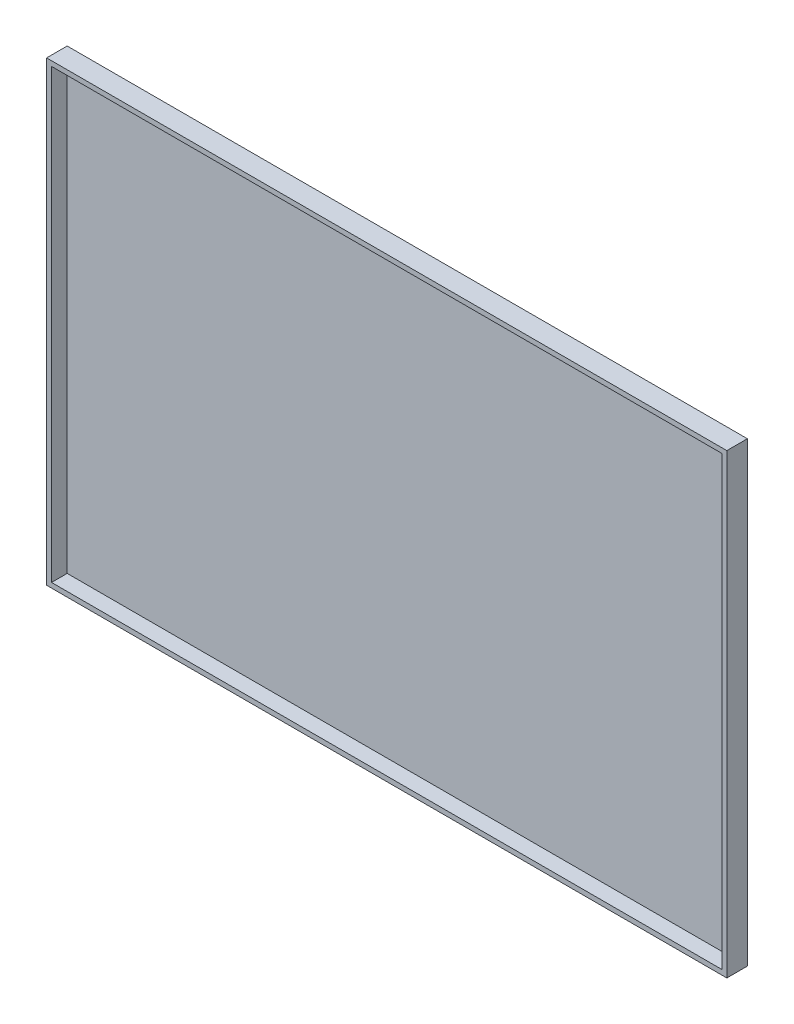
ISO-10303-21;
HEADER;
FILE_DESCRIPTION(('STEP AP214'),'2;1');
FILE_NAME('part.step','',(''),(''),'','','');
FILE_SCHEMA(('AUTOMOTIVE_DESIGN { 1 0 10303 214 1 1 1 1 }'));
ENDSEC;
DATA;
#1=APPLICATION_CONTEXT('core data for automotive mechanical design processes');
#2=APPLICATION_PROTOCOL_DEFINITION('international standard','automotive_design',2000,#1);
#3=PRODUCT_CONTEXT('',#1,'mechanical');
#4=PRODUCT('Part','Part','',(#3));
#5=PRODUCT_RELATED_PRODUCT_CATEGORY('part','',(#4));
#6=PRODUCT_DEFINITION_FORMATION('','',#4);
#7=PRODUCT_DEFINITION_CONTEXT('part definition',#1,'design');
#8=PRODUCT_DEFINITION('design','',#6,#7);
#9=PRODUCT_DEFINITION_SHAPE('','',#8);
#10=(LENGTH_UNIT() NAMED_UNIT(*) SI_UNIT(.MILLI.,.METRE.));
#11=(NAMED_UNIT(*) PLANE_ANGLE_UNIT() SI_UNIT($,.RADIAN.));
#12=(NAMED_UNIT(*) SI_UNIT($,.STERADIAN.) SOLID_ANGLE_UNIT());
#13=UNCERTAINTY_MEASURE_WITH_UNIT(LENGTH_MEASURE(1.E-05),#10,'distance_accuracy_value','');
#14=(GEOMETRIC_REPRESENTATION_CONTEXT(3) GLOBAL_UNCERTAINTY_ASSIGNED_CONTEXT((#13)) GLOBAL_UNIT_ASSIGNED_CONTEXT((#10,
#11,#12)) REPRESENTATION_CONTEXT('',''));
#15=CARTESIAN_POINT('',(0.,0.,0.));
#16=DIRECTION('',(0.,0.,1.));
#17=DIRECTION('',(1.,0.,0.));
#18=AXIS2_PLACEMENT_3D('',#15,#16,#17);
#19=CARTESIAN_POINT('',(1522.,1022.,92.));
#20=DIRECTION('',(1.,0.,0.));
#21=DIRECTION('',(0.,1.,0.));
#22=AXIS2_PLACEMENT_3D('',#19,#20,#21);
#23=PLANE('',#22);
#24=DIRECTION('',(0.,-1.,0.));
#25=VECTOR('',#24,1.);
#26=CARTESIAN_POINT('',(1522.,1022.,0.));
#27=LINE('',#26,#25);
#28=CARTESIAN_POINT('',(1522.,1022.,0.));
#29=VERTEX_POINT('',#28);
#30=CARTESIAN_POINT('',(1522.,-1022.,0.));
#31=VERTEX_POINT('',#30);
#32=EDGE_CURVE('E141',#29,#31,#27,.T.);
#33=ORIENTED_EDGE('',*,*,#32,.F.);
#34=DIRECTION('',(0.,0.,-1.));
#35=VECTOR('',#34,1.);
#36=CARTESIAN_POINT('',(1522.,1022.,92.));
#37=LINE('',#36,#35);
#38=CARTESIAN_POINT('',(1522.,1022.,92.));
#39=VERTEX_POINT('',#38);
#40=EDGE_CURVE('E12',#39,#29,#37,.T.);
#41=ORIENTED_EDGE('',*,*,#40,.F.);
#42=DIRECTION('',(0.,-1.,0.));
#43=VECTOR('',#42,1.);
#44=CARTESIAN_POINT('',(1522.,1022.,92.));
#45=LINE('',#44,#43);
#46=CARTESIAN_POINT('',(1522.,-1022.,92.));
#47=VERTEX_POINT('',#46);
#48=EDGE_CURVE('E145',#39,#47,#45,.T.);
#49=ORIENTED_EDGE('',*,*,#48,.T.);
#50=DIRECTION('',(0.,0.,-1.));
#51=VECTOR('',#50,1.);
#52=CARTESIAN_POINT('',(1522.,-1022.,92.));
#53=LINE('',#52,#51);
#54=EDGE_CURVE('E46',#47,#31,#53,.T.);
#55=ORIENTED_EDGE('',*,*,#54,.T.);
#56=EDGE_LOOP('',(#33,#41,#49,#55));
#57=FACE_BOUND('',#56,.T.);
#58=ADVANCED_FACE('F43',(#57),#23,.T.);
#59=CARTESIAN_POINT('',(1522.,1022.,92.));
#60=DIRECTION('',(0.,1.,0.));
#61=DIRECTION('',(0.,0.,1.));
#62=AXIS2_PLACEMENT_3D('',#59,#60,#61);
#63=PLANE('',#62);
#64=DIRECTION('',(1.,0.,0.));
#65=VECTOR('',#64,1.);
#66=CARTESIAN_POINT('',(1522.,1022.,0.));
#67=LINE('',#66,#65);
#68=CARTESIAN_POINT('',(-1522.,1022.,0.));
#69=VERTEX_POINT('',#68);
#70=EDGE_CURVE('E149',#69,#29,#67,.T.);
#71=ORIENTED_EDGE('',*,*,#70,.F.);
#72=DIRECTION('',(0.,0.,-1.));
#73=VECTOR('',#72,1.);
#74=CARTESIAN_POINT('',(-1522.,1022.,92.));
#75=LINE('',#74,#73);
#76=CARTESIAN_POINT('',(-1522.,1022.,92.));
#77=VERTEX_POINT('',#76);
#78=EDGE_CURVE('E51',#77,#69,#75,.T.);
#79=ORIENTED_EDGE('',*,*,#78,.F.);
#80=DIRECTION('',(1.,0.,0.));
#81=VECTOR('',#80,1.);
#82=CARTESIAN_POINT('',(1522.,1022.,92.));
#83=LINE('',#82,#81);
#84=EDGE_CURVE('E155',#77,#39,#83,.T.);
#85=ORIENTED_EDGE('',*,*,#84,.T.);
#86=ORIENTED_EDGE('',*,*,#40,.T.);
#87=EDGE_LOOP('',(#71,#79,#85,#86));
#88=FACE_BOUND('',#87,.T.);
#89=ADVANCED_FACE('F181',(#88),#63,.T.);
#90=CARTESIAN_POINT('',(-1522.,1022.,92.));
#91=DIRECTION('',(-1.,0.,0.));
#92=DIRECTION('',(0.,-1.,0.));
#93=AXIS2_PLACEMENT_3D('',#90,#91,#92);
#94=PLANE('',#93);
#95=DIRECTION('',(0.,1.,0.));
#96=VECTOR('',#95,1.);
#97=CARTESIAN_POINT('',(-1522.,1022.,0.));
#98=LINE('',#97,#96);
#99=CARTESIAN_POINT('',(-1522.,-1022.,0.));
#100=VERTEX_POINT('',#99);
#101=EDGE_CURVE('E163',#100,#69,#98,.T.);
#102=ORIENTED_EDGE('',*,*,#101,.F.);
#103=DIRECTION('',(0.,0.,-1.));
#104=VECTOR('',#103,1.);
#105=CARTESIAN_POINT('',(-1522.,-1022.,92.));
#106=LINE('',#105,#104);
#107=CARTESIAN_POINT('',(-1522.,-1022.,92.));
#108=VERTEX_POINT('',#107);
#109=EDGE_CURVE('E168',#108,#100,#106,.T.);
#110=ORIENTED_EDGE('',*,*,#109,.F.);
#111=DIRECTION('',(0.,1.,0.));
#112=VECTOR('',#111,1.);
#113=CARTESIAN_POINT('',(-1522.,1022.,92.));
#114=LINE('',#113,#112);
#115=EDGE_CURVE('E152',#108,#77,#114,.T.);
#116=ORIENTED_EDGE('',*,*,#115,.T.);
#117=ORIENTED_EDGE('',*,*,#78,.T.);
#118=EDGE_LOOP('',(#102,#110,#116,#117));
#119=FACE_BOUND('',#118,.T.);
#120=ADVANCED_FACE('F185',(#119),#94,.T.);
#121=CARTESIAN_POINT('',(1522.,-1022.,92.));
#122=DIRECTION('',(0.,-1.,0.));
#123=DIRECTION('',(0.,0.,-1.));
#124=AXIS2_PLACEMENT_3D('',#121,#122,#123);
#125=PLANE('',#124);
#126=DIRECTION('',(-1.,0.,0.));
#127=VECTOR('',#126,1.);
#128=CARTESIAN_POINT('',(1522.,-1022.,0.));
#129=LINE('',#128,#127);
#130=EDGE_CURVE('E160',#31,#100,#129,.T.);
#131=ORIENTED_EDGE('',*,*,#130,.F.);
#132=ORIENTED_EDGE('',*,*,#54,.F.);
#133=DIRECTION('',(-1.,0.,0.));
#134=VECTOR('',#133,1.);
#135=CARTESIAN_POINT('',(1522.,-1022.,92.));
#136=LINE('',#135,#134);
#137=EDGE_CURVE('E148',#47,#108,#136,.T.);
#138=ORIENTED_EDGE('',*,*,#137,.T.);
#139=ORIENTED_EDGE('',*,*,#109,.T.);
#140=EDGE_LOOP('',(#131,#132,#138,#139));
#141=FACE_BOUND('',#140,.T.);
#142=ADVANCED_FACE('F176',(#141),#125,.T.);
#143=CARTESIAN_POINT('',(0.,0.,92.));
#144=DIRECTION('',(0.,0.,-1.));
#145=DIRECTION('',(-1.,0.,0.));
#146=AXIS2_PLACEMENT_3D('',#143,#144,#145);
#147=PLANE('',#146);
#148=DIRECTION('',(-1.,0.,0.));
#149=VECTOR('',#148,1.);
#150=CARTESIAN_POINT('',(-1500.,-1000.,92.));
#151=LINE('',#150,#149);
#152=CARTESIAN_POINT('',(1500.,-1000.,92.));
#153=VERTEX_POINT('',#152);
#154=CARTESIAN_POINT('',(-1500.,-1000.,92.));
#155=VERTEX_POINT('',#154);
#156=EDGE_CURVE('E116',#153,#155,#151,.T.);
#157=ORIENTED_EDGE('',*,*,#156,.T.);
#158=DIRECTION('',(0.,1.,0.));
#159=VECTOR('',#158,1.);
#160=CARTESIAN_POINT('',(-1500.,1000.,92.));
#161=LINE('',#160,#159);
#162=CARTESIAN_POINT('',(-1500.,1000.,92.));
#163=VERTEX_POINT('',#162);
#164=EDGE_CURVE('E110',#155,#163,#161,.T.);
#165=ORIENTED_EDGE('',*,*,#164,.T.);
#166=DIRECTION('',(1.,0.,0.));
#167=VECTOR('',#166,1.);
#168=CARTESIAN_POINT('',(-1500.,1000.,92.));
#169=LINE('',#168,#167);
#170=CARTESIAN_POINT('',(1500.,1000.,92.));
#171=VERTEX_POINT('',#170);
#172=EDGE_CURVE('E119',#163,#171,#169,.T.);
#173=ORIENTED_EDGE('',*,*,#172,.T.);
#174=DIRECTION('',(0.,-1.,0.));
#175=VECTOR('',#174,1.);
#176=CARTESIAN_POINT('',(1500.,1000.,92.));
#177=LINE('',#176,#175);
#178=EDGE_CURVE('E59',#171,#153,#177,.T.);
#179=ORIENTED_EDGE('',*,*,#178,.T.);
#180=EDGE_LOOP('',(#157,#165,#173,#179));
#181=FACE_BOUND('',#180,.T.);
#182=ORIENTED_EDGE('',*,*,#48,.F.);
#183=ORIENTED_EDGE('',*,*,#84,.F.);
#184=ORIENTED_EDGE('',*,*,#115,.F.);
#185=ORIENTED_EDGE('',*,*,#137,.F.);
#186=EDGE_LOOP('',(#182,#183,#184,#185));
#187=FACE_BOUND('',#186,.T.);
#188=ADVANCED_FACE('F123',(#181,#187),#147,.F.);
#189=CARTESIAN_POINT('',(0.,0.,0.));
#190=DIRECTION('',(0.,0.,-1.));
#191=DIRECTION('',(-1.,0.,0.));
#192=AXIS2_PLACEMENT_3D('',#189,#190,#191);
#193=PLANE('',#192);
#194=DIRECTION('',(0.,1.,0.));
#195=VECTOR('',#194,1.);
#196=CARTESIAN_POINT('',(-1500.,1000.,0.));
#197=LINE('',#196,#195);
#198=CARTESIAN_POINT('',(-1500.,-1000.,0.));
#199=VERTEX_POINT('',#198);
#200=CARTESIAN_POINT('',(-1500.,1000.,0.));
#201=VERTEX_POINT('',#200);
#202=EDGE_CURVE('E67',#199,#201,#197,.T.);
#203=ORIENTED_EDGE('',*,*,#202,.F.);
#204=DIRECTION('',(-1.,0.,0.));
#205=VECTOR('',#204,1.);
#206=CARTESIAN_POINT('',(-1500.,-1000.,0.));
#207=LINE('',#206,#205);
#208=CARTESIAN_POINT('',(1500.,-1000.,0.));
#209=VERTEX_POINT('',#208);
#210=EDGE_CURVE('E126',#209,#199,#207,.T.);
#211=ORIENTED_EDGE('',*,*,#210,.F.);
#212=DIRECTION('',(0.,-1.,0.));
#213=VECTOR('',#212,1.);
#214=CARTESIAN_POINT('',(1500.,1000.,0.));
#215=LINE('',#214,#213);
#216=CARTESIAN_POINT('',(1500.,1000.,0.));
#217=VERTEX_POINT('',#216);
#218=EDGE_CURVE('E129',#217,#209,#215,.T.);
#219=ORIENTED_EDGE('',*,*,#218,.F.);
#220=DIRECTION('',(1.,0.,0.));
#221=VECTOR('',#220,1.);
#222=CARTESIAN_POINT('',(-1500.,1000.,0.));
#223=LINE('',#222,#221);
#224=EDGE_CURVE('E135',#201,#217,#223,.T.);
#225=ORIENTED_EDGE('',*,*,#224,.F.);
#226=EDGE_LOOP('',(#203,#211,#219,#225));
#227=FACE_BOUND('',#226,.T.);
#228=ORIENTED_EDGE('',*,*,#32,.T.);
#229=ORIENTED_EDGE('',*,*,#130,.T.);
#230=ORIENTED_EDGE('',*,*,#101,.T.);
#231=ORIENTED_EDGE('',*,*,#70,.T.);
#232=EDGE_LOOP('',(#228,#229,#230,#231));
#233=FACE_BOUND('',#232,.T.);
#234=ADVANCED_FACE('F178',(#227,#233),#193,.T.);
#235=CARTESIAN_POINT('',(-1500.,1000.,92.));
#236=DIRECTION('',(-1.,0.,0.));
#237=DIRECTION('',(0.,0.,1.));
#238=AXIS2_PLACEMENT_3D('',#235,#236,#237);
#239=PLANE('',#238);
#240=ORIENTED_EDGE('',*,*,#202,.T.);
#241=DIRECTION('',(0.,0.,-1.));
#242=VECTOR('',#241,1.);
#243=CARTESIAN_POINT('',(-1500.,1000.,92.));
#244=LINE('',#243,#242);
#245=EDGE_CURVE('E106',#163,#201,#244,.T.);
#246=ORIENTED_EDGE('',*,*,#245,.F.);
#247=ORIENTED_EDGE('',*,*,#164,.F.);
#248=DIRECTION('',(0.,0.,-1.));
#249=VECTOR('',#248,1.);
#250=CARTESIAN_POINT('',(-1500.,-1000.,92.));
#251=LINE('',#250,#249);
#252=EDGE_CURVE('E139',#155,#199,#251,.T.);
#253=ORIENTED_EDGE('',*,*,#252,.T.);
#254=EDGE_LOOP('',(#240,#246,#247,#253));
#255=FACE_BOUND('',#254,.T.);
#256=ADVANCED_FACE('F108',(#255),#239,.F.);
#257=CARTESIAN_POINT('',(-1500.,-1000.,92.));
#258=DIRECTION('',(0.,-1.,0.));
#259=DIRECTION('',(1.,0.,0.));
#260=AXIS2_PLACEMENT_3D('',#257,#258,#259);
#261=PLANE('',#260);
#262=ORIENTED_EDGE('',*,*,#210,.T.);
#263=ORIENTED_EDGE('',*,*,#252,.F.);
#264=ORIENTED_EDGE('',*,*,#156,.F.);
#265=DIRECTION('',(0.,0.,-1.));
#266=VECTOR('',#265,1.);
#267=CARTESIAN_POINT('',(1500.,-1000.,92.));
#268=LINE('',#267,#266);
#269=EDGE_CURVE('E142',#153,#209,#268,.T.);
#270=ORIENTED_EDGE('',*,*,#269,.T.);
#271=EDGE_LOOP('',(#262,#263,#264,#270));
#272=FACE_BOUND('',#271,.T.);
#273=ADVANCED_FACE('F236',(#272),#261,.F.);
#274=CARTESIAN_POINT('',(1500.,1000.,92.));
#275=DIRECTION('',(1.,0.,0.));
#276=DIRECTION('',(0.,1.,0.));
#277=AXIS2_PLACEMENT_3D('',#274,#275,#276);
#278=PLANE('',#277);
#279=ORIENTED_EDGE('',*,*,#218,.T.);
#280=ORIENTED_EDGE('',*,*,#269,.F.);
#281=ORIENTED_EDGE('',*,*,#178,.F.);
#282=DIRECTION('',(0.,0.,-1.));
#283=VECTOR('',#282,1.);
#284=CARTESIAN_POINT('',(1500.,1000.,92.));
#285=LINE('',#284,#283);
#286=EDGE_CURVE('E115',#171,#217,#285,.T.);
#287=ORIENTED_EDGE('',*,*,#286,.T.);
#288=EDGE_LOOP('',(#279,#280,#281,#287));
#289=FACE_BOUND('',#288,.T.);
#290=ADVANCED_FACE('F245',(#289),#278,.F.);
#291=CARTESIAN_POINT('',(-1500.,1000.,92.));
#292=DIRECTION('',(0.,1.,0.));
#293=DIRECTION('',(0.,0.,1.));
#294=AXIS2_PLACEMENT_3D('',#291,#292,#293);
#295=PLANE('',#294);
#296=ORIENTED_EDGE('',*,*,#224,.T.);
#297=ORIENTED_EDGE('',*,*,#286,.F.);
#298=ORIENTED_EDGE('',*,*,#172,.F.);
#299=ORIENTED_EDGE('',*,*,#245,.T.);
#300=EDGE_LOOP('',(#296,#297,#298,#299));
#301=FACE_BOUND('',#300,.T.);
#302=ADVANCED_FACE('F120',(#301),#295,.F.);
#303=CLOSED_SHELL('',(#58,#89,#120,#142,#188,#234,#256,#273,#290,#302));
#304=MANIFOLD_SOLID_BREP('B2',#303);
#305=CARTESIAN_POINT('',(-1500.,1000.,22.));
#306=DIRECTION('',(1.,0.,0.));
#307=DIRECTION('',(0.,0.,-1.));
#308=AXIS2_PLACEMENT_3D('',#305,#306,#307);
#309=PLANE('',#308);
#310=DIRECTION('',(0.,-1.,0.));
#311=VECTOR('',#310,1.);
#312=CARTESIAN_POINT('',(-1500.,1000.,0.));
#313=LINE('',#312,#311);
#314=CARTESIAN_POINT('',(-1500.,1000.,0.));
#315=VERTEX_POINT('',#314);
#316=CARTESIAN_POINT('',(-1500.,-1000.,0.));
#317=VERTEX_POINT('',#316);
#318=EDGE_CURVE('E335',#315,#317,#313,.T.);
#319=ORIENTED_EDGE('',*,*,#318,.T.);
#320=DIRECTION('',(0.,0.,-1.));
#321=VECTOR('',#320,1.);
#322=CARTESIAN_POINT('',(-1500.,-1000.,22.));
#323=LINE('',#322,#321);
#324=CARTESIAN_POINT('',(-1500.,-1000.,22.));
#325=VERTEX_POINT('',#324);
#326=EDGE_CURVE('E41',#325,#317,#323,.T.);
#327=ORIENTED_EDGE('',*,*,#326,.F.);
#328=DIRECTION('',(0.,-1.,0.));
#329=VECTOR('',#328,1.);
#330=CARTESIAN_POINT('',(-1500.,1000.,22.));
#331=LINE('',#330,#329);
#332=CARTESIAN_POINT('',(-1500.,1000.,22.));
#333=VERTEX_POINT('',#332);
#334=EDGE_CURVE('E323',#333,#325,#331,.T.);
#335=ORIENTED_EDGE('',*,*,#334,.F.);
#336=DIRECTION('',(0.,0.,-1.));
#337=VECTOR('',#336,1.);
#338=CARTESIAN_POINT('',(-1500.,1000.,22.));
#339=LINE('',#338,#337);
#340=EDGE_CURVE('E331',#333,#315,#339,.T.);
#341=ORIENTED_EDGE('',*,*,#340,.T.);
#342=EDGE_LOOP('',(#319,#327,#335,#341));
#343=FACE_BOUND('',#342,.T.);
#344=ADVANCED_FACE('F272',(#343),#309,.F.);
#345=CARTESIAN_POINT('',(-1500.,-1000.,22.));
#346=DIRECTION('',(0.,1.,0.));
#347=DIRECTION('',(-1.,0.,0.));
#348=AXIS2_PLACEMENT_3D('',#345,#346,#347);
#349=PLANE('',#348);
#350=DIRECTION('',(1.,0.,0.));
#351=VECTOR('',#350,1.);
#352=CARTESIAN_POINT('',(-1500.,-1000.,0.));
#353=LINE('',#352,#351);
#354=CARTESIAN_POINT('',(1500.,-1000.,0.));
#355=VERTEX_POINT('',#354);
#356=EDGE_CURVE('E327',#317,#355,#353,.T.);
#357=ORIENTED_EDGE('',*,*,#356,.T.);
#358=DIRECTION('',(0.,0.,-1.));
#359=VECTOR('',#358,1.);
#360=CARTESIAN_POINT('',(1500.,-1000.,22.));
#361=LINE('',#360,#359);
#362=CARTESIAN_POINT('',(1500.,-1000.,22.));
#363=VERTEX_POINT('',#362);
#364=EDGE_CURVE('E280',#363,#355,#361,.T.);
#365=ORIENTED_EDGE('',*,*,#364,.F.);
#366=DIRECTION('',(1.,0.,0.));
#367=VECTOR('',#366,1.);
#368=CARTESIAN_POINT('',(-1500.,-1000.,22.));
#369=LINE('',#368,#367);
#370=EDGE_CURVE('E318',#325,#363,#369,.T.);
#371=ORIENTED_EDGE('',*,*,#370,.F.);
#372=ORIENTED_EDGE('',*,*,#326,.T.);
#373=EDGE_LOOP('',(#357,#365,#371,#372));
#374=FACE_BOUND('',#373,.T.);
#375=ADVANCED_FACE('F326',(#374),#349,.F.);
#376=CARTESIAN_POINT('',(1500.,1000.,22.));
#377=DIRECTION('',(-1.,0.,0.));
#378=DIRECTION('',(0.,0.,1.));
#379=AXIS2_PLACEMENT_3D('',#376,#377,#378);
#380=PLANE('',#379);
#381=DIRECTION('',(0.,1.,0.));
#382=VECTOR('',#381,1.);
#383=CARTESIAN_POINT('',(1500.,1000.,0.));
#384=LINE('',#383,#382);
#385=CARTESIAN_POINT('',(1500.,1000.,0.));
#386=VERTEX_POINT('',#385);
#387=EDGE_CURVE('E305',#355,#386,#384,.T.);
#388=ORIENTED_EDGE('',*,*,#387,.T.);
#389=DIRECTION('',(0.,0.,-1.));
#390=VECTOR('',#389,1.);
#391=CARTESIAN_POINT('',(1500.,1000.,22.));
#392=LINE('',#391,#390);
#393=CARTESIAN_POINT('',(1500.,1000.,22.));
#394=VERTEX_POINT('',#393);
#395=EDGE_CURVE('E328',#394,#386,#392,.T.);
#396=ORIENTED_EDGE('',*,*,#395,.F.);
#397=DIRECTION('',(0.,1.,0.));
#398=VECTOR('',#397,1.);
#399=CARTESIAN_POINT('',(1500.,1000.,22.));
#400=LINE('',#399,#398);
#401=EDGE_CURVE('E321',#363,#394,#400,.T.);
#402=ORIENTED_EDGE('',*,*,#401,.F.);
#403=ORIENTED_EDGE('',*,*,#364,.T.);
#404=EDGE_LOOP('',(#388,#396,#402,#403));
#405=FACE_BOUND('',#404,.T.);
#406=ADVANCED_FACE('F329',(#405),#380,.F.);
#407=CARTESIAN_POINT('',(-1500.,1000.,22.));
#408=DIRECTION('',(0.,-1.,0.));
#409=DIRECTION('',(1.,0.,0.));
#410=AXIS2_PLACEMENT_3D('',#407,#408,#409);
#411=PLANE('',#410);
#412=DIRECTION('',(-1.,0.,0.));
#413=VECTOR('',#412,1.);
#414=CARTESIAN_POINT('',(-1500.,1000.,0.));
#415=LINE('',#414,#413);
#416=EDGE_CURVE('E311',#386,#315,#415,.T.);
#417=ORIENTED_EDGE('',*,*,#416,.T.);
#418=ORIENTED_EDGE('',*,*,#340,.F.);
#419=DIRECTION('',(-1.,0.,0.));
#420=VECTOR('',#419,1.);
#421=CARTESIAN_POINT('',(-1500.,1000.,22.));
#422=LINE('',#421,#420);
#423=EDGE_CURVE('E288',#394,#333,#422,.T.);
#424=ORIENTED_EDGE('',*,*,#423,.F.);
#425=ORIENTED_EDGE('',*,*,#395,.T.);
#426=EDGE_LOOP('',(#417,#418,#424,#425));
#427=FACE_BOUND('',#426,.T.);
#428=ADVANCED_FACE('F342',(#427),#411,.F.);
#429=CARTESIAN_POINT('',(0.,0.,22.));
#430=DIRECTION('',(0.,0.,1.));
#431=DIRECTION('',(1.,0.,0.));
#432=AXIS2_PLACEMENT_3D('',#429,#430,#431);
#433=PLANE('',#432);
#434=ORIENTED_EDGE('',*,*,#334,.T.);
#435=ORIENTED_EDGE('',*,*,#370,.T.);
#436=ORIENTED_EDGE('',*,*,#401,.T.);
#437=ORIENTED_EDGE('',*,*,#423,.T.);
#438=EDGE_LOOP('',(#434,#435,#436,#437));
#439=FACE_BOUND('',#438,.T.);
#440=ADVANCED_FACE('F319',(#439),#433,.T.);
#441=CARTESIAN_POINT('',(0.,0.,0.));
#442=DIRECTION('',(0.,0.,1.));
#443=DIRECTION('',(1.,0.,0.));
#444=AXIS2_PLACEMENT_3D('',#441,#442,#443);
#445=PLANE('',#444);
#446=ORIENTED_EDGE('',*,*,#318,.F.);
#447=ORIENTED_EDGE('',*,*,#416,.F.);
#448=ORIENTED_EDGE('',*,*,#387,.F.);
#449=ORIENTED_EDGE('',*,*,#356,.F.);
#450=EDGE_LOOP('',(#446,#447,#448,#449));
#451=FACE_BOUND('',#450,.T.);
#452=ADVANCED_FACE('F345',(#451),#445,.F.);
#453=CLOSED_SHELL('',(#344,#375,#406,#428,#440,#452));
#454=MANIFOLD_SOLID_BREP('B6',#453);
#455=ADVANCED_BREP_SHAPE_REPRESENTATION('',(#18,#304,#454),#14);
#456=SHAPE_DEFINITION_REPRESENTATION(#9,#455);
ENDSEC;
END-ISO-10303-21;
